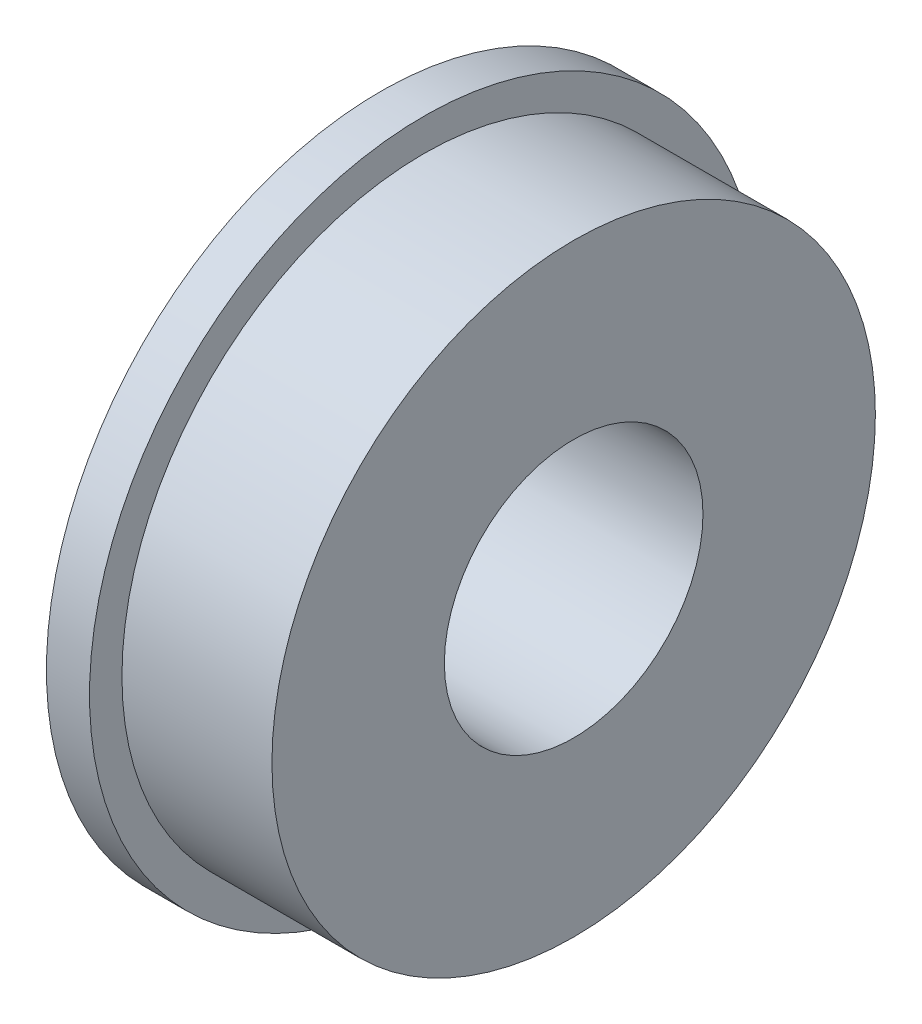
ISO-10303-21;
HEADER;
FILE_DESCRIPTION(('STEP AP214'),'2;1');
FILE_NAME('part.step','',(''),(''),'','','');
FILE_SCHEMA(('AUTOMOTIVE_DESIGN { 1 0 10303 214 1 1 1 1 }'));
ENDSEC;
DATA;
#1=APPLICATION_CONTEXT('core data for automotive mechanical design processes');
#2=APPLICATION_PROTOCOL_DEFINITION('international standard','automotive_design',2000,#1);
#3=PRODUCT_CONTEXT('',#1,'mechanical');
#4=PRODUCT('Part','Part','',(#3));
#5=PRODUCT_RELATED_PRODUCT_CATEGORY('part','',(#4));
#6=PRODUCT_DEFINITION_FORMATION('','',#4);
#7=PRODUCT_DEFINITION_CONTEXT('part definition',#1,'design');
#8=PRODUCT_DEFINITION('design','',#6,#7);
#9=PRODUCT_DEFINITION_SHAPE('','',#8);
#10=(LENGTH_UNIT() NAMED_UNIT(*) SI_UNIT(.MILLI.,.METRE.));
#11=(NAMED_UNIT(*) PLANE_ANGLE_UNIT() SI_UNIT($,.RADIAN.));
#12=(NAMED_UNIT(*) SI_UNIT($,.STERADIAN.) SOLID_ANGLE_UNIT());
#13=UNCERTAINTY_MEASURE_WITH_UNIT(LENGTH_MEASURE(1.E-05),#10,'distance_accuracy_value','');
#14=(GEOMETRIC_REPRESENTATION_CONTEXT(3) GLOBAL_UNCERTAINTY_ASSIGNED_CONTEXT((#13)) GLOBAL_UNIT_ASSIGNED_CONTEXT((#10,
#11,#12)) REPRESENTATION_CONTEXT('',''));
#15=CARTESIAN_POINT('',(0.,0.,0.));
#16=DIRECTION('',(0.,0.,1.));
#17=DIRECTION('',(1.,0.,0.));
#18=AXIS2_PLACEMENT_3D('',#15,#16,#17);
#19=CARTESIAN_POINT('',(0.,0.,0.));
#20=DIRECTION('',(-1.,0.,0.));
#21=DIRECTION('',(0.,0.,-1.));
#22=AXIS2_PLACEMENT_3D('',#19,#20,#21);
#23=CYLINDRICAL_SURFACE('',#22,9.906);
#24=CARTESIAN_POINT('',(0.381,0.,0.));
#25=DIRECTION('',(1.,0.,0.));
#26=DIRECTION('',(0.,0.,-1.));
#27=AXIS2_PLACEMENT_3D('',#24,#25,#26);
#28=CIRCLE('',#27,9.906);
#29=CARTESIAN_POINT('',(0.381,0.,-9.906));
#30=VERTEX_POINT('',#29);
#31=EDGE_CURVE('E66',#30,#30,#28,.F.);
#32=ORIENTED_EDGE('',*,*,#31,.F.);
#33=EDGE_LOOP('',(#32));
#34=FACE_BOUND('',#33,.T.);
#35=CARTESIAN_POINT('',(0.,0.,0.));
#36=DIRECTION('',(1.,0.,0.));
#37=DIRECTION('',(0.,0.,-1.));
#38=AXIS2_PLACEMENT_3D('',#35,#36,#37);
#39=CIRCLE('',#38,9.906);
#40=CARTESIAN_POINT('',(0.,0.,-9.906));
#41=VERTEX_POINT('',#40);
#42=EDGE_CURVE('E38',#41,#41,#39,.T.);
#43=ORIENTED_EDGE('',*,*,#42,.F.);
#44=EDGE_LOOP('',(#43));
#45=FACE_BOUND('',#44,.T.);
#46=ADVANCED_FACE('F35',(#34,#45),#23,.F.);
#47=CARTESIAN_POINT('',(0.,12.3063,0.));
#48=DIRECTION('',(1.,0.,0.));
#49=DIRECTION('',(0.,0.,1.));
#50=AXIS2_PLACEMENT_3D('',#47,#48,#49);
#51=PLANE('',#50);
#52=CARTESIAN_POINT('',(0.,0.,0.));
#53=DIRECTION('',(1.,0.,0.));
#54=DIRECTION('',(0.,0.,-1.));
#55=AXIS2_PLACEMENT_3D('',#52,#53,#54);
#56=CIRCLE('',#55,12.3063);
#57=CARTESIAN_POINT('',(0.,0.,-12.3063));
#58=VERTEX_POINT('',#57);
#59=EDGE_CURVE('E64',#58,#58,#56,.F.);
#60=ORIENTED_EDGE('',*,*,#59,.T.);
#61=EDGE_LOOP('',(#60));
#62=FACE_BOUND('',#61,.T.);
#63=ORIENTED_EDGE('',*,*,#42,.T.);
#64=EDGE_LOOP('',(#63));
#65=FACE_BOUND('',#64,.T.);
#66=ADVANCED_FACE('F73',(#62,#65),#51,.F.);
#67=CARTESIAN_POINT('',(0.381,9.906,0.));
#68=DIRECTION('',(1.,0.,0.));
#69=DIRECTION('',(0.,0.,1.));
#70=AXIS2_PLACEMENT_3D('',#67,#68,#69);
#71=PLANE('',#70);
#72=ORIENTED_EDGE('',*,*,#31,.T.);
#73=EDGE_LOOP('',(#72));
#74=FACE_BOUND('',#73,.T.);
#75=CARTESIAN_POINT('',(0.381,0.,0.));
#76=DIRECTION('',(1.,0.,0.));
#77=DIRECTION('',(0.,0.,-1.));
#78=AXIS2_PLACEMENT_3D('',#75,#76,#77);
#79=CIRCLE('',#78,6.35);
#80=CARTESIAN_POINT('',(0.381,0.,-6.35));
#81=VERTEX_POINT('',#80);
#82=EDGE_CURVE('E61',#81,#81,#79,.T.);
#83=ORIENTED_EDGE('',*,*,#82,.T.);
#84=EDGE_LOOP('',(#83));
#85=FACE_BOUND('',#84,.T.);
#86=ADVANCED_FACE('F80',(#74,#85),#71,.F.);
#87=CARTESIAN_POINT('',(0.,0.,0.));
#88=DIRECTION('',(-1.,0.,0.));
#89=DIRECTION('',(0.,0.,-1.));
#90=AXIS2_PLACEMENT_3D('',#87,#88,#89);
#91=CYLINDRICAL_SURFACE('',#90,12.3063);
#92=ORIENTED_EDGE('',*,*,#59,.F.);
#93=EDGE_LOOP('',(#92));
#94=FACE_BOUND('',#93,.T.);
#95=CARTESIAN_POINT('',(1.5875,0.,0.));
#96=DIRECTION('',(1.,0.,0.));
#97=DIRECTION('',(0.,0.,-1.));
#98=AXIS2_PLACEMENT_3D('',#95,#96,#97);
#99=CIRCLE('',#98,12.3063);
#100=CARTESIAN_POINT('',(1.5875,0.,-12.3063));
#101=VERTEX_POINT('',#100);
#102=EDGE_CURVE('E58',#101,#101,#99,.T.);
#103=ORIENTED_EDGE('',*,*,#102,.F.);
#104=EDGE_LOOP('',(#103));
#105=FACE_BOUND('',#104,.T.);
#106=ADVANCED_FACE('F85',(#94,#105),#91,.T.);
#107=CARTESIAN_POINT('',(0.,0.,0.));
#108=DIRECTION('',(-1.,0.,0.));
#109=DIRECTION('',(0.,0.,-1.));
#110=AXIS2_PLACEMENT_3D('',#107,#108,#109);
#111=CYLINDRICAL_SURFACE('',#110,6.35);
#112=CARTESIAN_POINT('',(0.,0.,0.));
#113=DIRECTION('',(1.,0.,0.));
#114=DIRECTION('',(0.,0.,-1.));
#115=AXIS2_PLACEMENT_3D('',#112,#113,#114);
#116=CIRCLE('',#115,6.35);
#117=CARTESIAN_POINT('',(0.,0.,-6.35));
#118=VERTEX_POINT('',#117);
#119=EDGE_CURVE('E55',#118,#118,#116,.F.);
#120=ORIENTED_EDGE('',*,*,#119,.F.);
#121=EDGE_LOOP('',(#120));
#122=FACE_BOUND('',#121,.T.);
#123=ORIENTED_EDGE('',*,*,#82,.F.);
#124=EDGE_LOOP('',(#123));
#125=FACE_BOUND('',#124,.T.);
#126=ADVANCED_FACE('F90',(#122,#125),#111,.T.);
#127=CARTESIAN_POINT('',(1.5875,11.1125,0.));
#128=DIRECTION('',(-1.,0.,0.));
#129=DIRECTION('',(0.,0.,-1.));
#130=AXIS2_PLACEMENT_3D('',#127,#128,#129);
#131=PLANE('',#130);
#132=CARTESIAN_POINT('',(1.5875,0.,0.));
#133=DIRECTION('',(1.,0.,0.));
#134=DIRECTION('',(0.,0.,-1.));
#135=AXIS2_PLACEMENT_3D('',#132,#133,#134);
#136=CIRCLE('',#135,11.1125);
#137=CARTESIAN_POINT('',(1.5875,0.,-11.1125));
#138=VERTEX_POINT('',#137);
#139=EDGE_CURVE('E52',#138,#138,#136,.F.);
#140=ORIENTED_EDGE('',*,*,#139,.T.);
#141=EDGE_LOOP('',(#140));
#142=FACE_BOUND('',#141,.T.);
#143=ORIENTED_EDGE('',*,*,#102,.T.);
#144=EDGE_LOOP('',(#143));
#145=FACE_BOUND('',#144,.T.);
#146=ADVANCED_FACE('F94',(#142,#145),#131,.F.);
#147=CARTESIAN_POINT('',(0.,6.35,0.));
#148=DIRECTION('',(1.,0.,0.));
#149=DIRECTION('',(0.,0.,1.));
#150=AXIS2_PLACEMENT_3D('',#147,#148,#149);
#151=PLANE('',#150);
#152=ORIENTED_EDGE('',*,*,#119,.T.);
#153=EDGE_LOOP('',(#152));
#154=FACE_BOUND('',#153,.T.);
#155=CARTESIAN_POINT('',(0.,0.,0.));
#156=DIRECTION('',(1.,0.,0.));
#157=DIRECTION('',(0.,0.,-1.));
#158=AXIS2_PLACEMENT_3D('',#155,#156,#157);
#159=CIRCLE('',#158,4.7625);
#160=CARTESIAN_POINT('',(0.,0.,-4.7625));
#161=VERTEX_POINT('',#160);
#162=EDGE_CURVE('E47',#161,#161,#159,.F.);
#163=ORIENTED_EDGE('',*,*,#162,.F.);
#164=EDGE_LOOP('',(#163));
#165=FACE_BOUND('',#164,.T.);
#166=ADVANCED_FACE('F98',(#154,#165),#151,.F.);
#167=CARTESIAN_POINT('',(0.,0.,0.));
#168=DIRECTION('',(-1.,0.,0.));
#169=DIRECTION('',(0.,0.,-1.));
#170=AXIS2_PLACEMENT_3D('',#167,#168,#169);
#171=CYLINDRICAL_SURFACE('',#170,11.1125);
#172=ORIENTED_EDGE('',*,*,#139,.F.);
#173=EDGE_LOOP('',(#172));
#174=FACE_BOUND('',#173,.T.);
#175=CARTESIAN_POINT('',(7.112,0.,0.));
#176=DIRECTION('',(1.,0.,0.));
#177=DIRECTION('',(0.,0.,-1.));
#178=AXIS2_PLACEMENT_3D('',#175,#176,#177);
#179=CIRCLE('',#178,11.1125);
#180=CARTESIAN_POINT('',(7.112,0.,-11.1125));
#181=VERTEX_POINT('',#180);
#182=EDGE_CURVE('E42',#181,#181,#179,.T.);
#183=ORIENTED_EDGE('',*,*,#182,.F.);
#184=EDGE_LOOP('',(#183));
#185=FACE_BOUND('',#184,.T.);
#186=ADVANCED_FACE('F102',(#174,#185),#171,.T.);
#187=CARTESIAN_POINT('',(0.,0.,0.));
#188=DIRECTION('',(-1.,0.,0.));
#189=DIRECTION('',(0.,0.,-1.));
#190=AXIS2_PLACEMENT_3D('',#187,#188,#189);
#191=CYLINDRICAL_SURFACE('',#190,4.7625);
#192=CARTESIAN_POINT('',(7.112,0.,0.));
#193=DIRECTION('',(1.,0.,0.));
#194=DIRECTION('',(0.,0.,-1.));
#195=AXIS2_PLACEMENT_3D('',#192,#193,#194);
#196=CIRCLE('',#195,4.7625);
#197=CARTESIAN_POINT('',(7.112,0.,-4.7625));
#198=VERTEX_POINT('',#197);
#199=EDGE_CURVE('E10',#198,#198,#196,.F.);
#200=ORIENTED_EDGE('',*,*,#199,.F.);
#201=EDGE_LOOP('',(#200));
#202=FACE_BOUND('',#201,.T.);
#203=ORIENTED_EDGE('',*,*,#162,.T.);
#204=EDGE_LOOP('',(#203));
#205=FACE_BOUND('',#204,.T.);
#206=ADVANCED_FACE('F106',(#202,#205),#191,.F.);
#207=CARTESIAN_POINT('',(7.112,4.7625,0.));
#208=DIRECTION('',(-1.,0.,0.));
#209=DIRECTION('',(0.,0.,-1.));
#210=AXIS2_PLACEMENT_3D('',#207,#208,#209);
#211=PLANE('',#210);
#212=ORIENTED_EDGE('',*,*,#199,.T.);
#213=EDGE_LOOP('',(#212));
#214=FACE_BOUND('',#213,.T.);
#215=ORIENTED_EDGE('',*,*,#182,.T.);
#216=EDGE_LOOP('',(#215));
#217=FACE_BOUND('',#216,.T.);
#218=ADVANCED_FACE('F110',(#214,#217),#211,.F.);
#219=CLOSED_SHELL('',(#46,#66,#86,#106,#126,#146,#166,#186,#206,#218));
#220=MANIFOLD_SOLID_BREP('B2',#219);
#221=ADVANCED_BREP_SHAPE_REPRESENTATION('',(#18,#220),#14);
#222=SHAPE_DEFINITION_REPRESENTATION(#9,#221);
ENDSEC;
END-ISO-10303-21;
